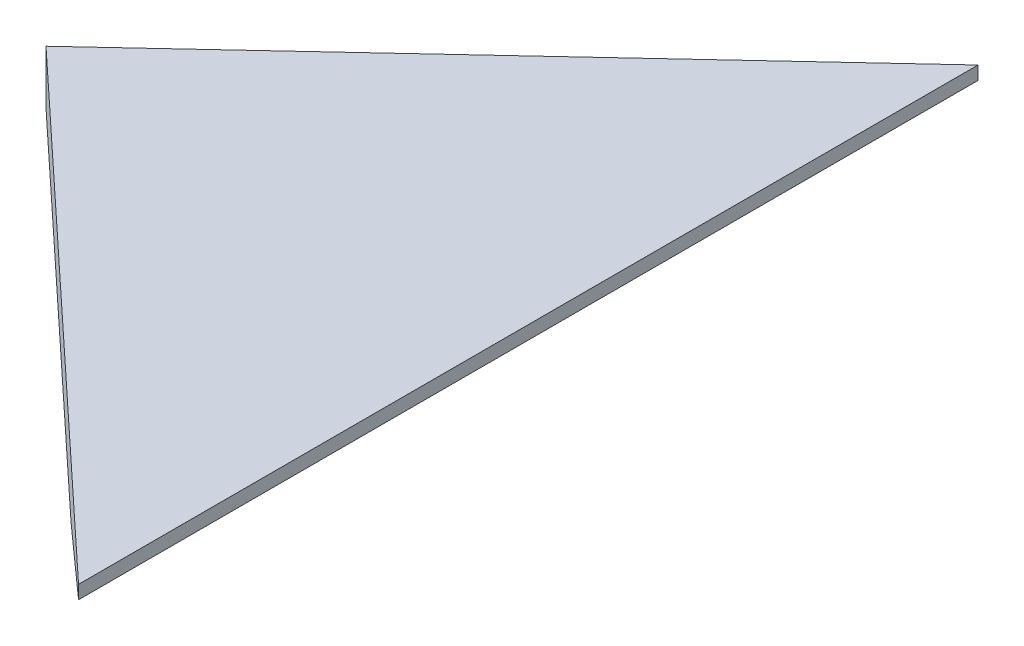
ISO-10303-21;
HEADER;
FILE_DESCRIPTION(('STEP AP214'),'2;1');
FILE_NAME('part.step','',(''),(''),'','','');
FILE_SCHEMA(('AUTOMOTIVE_DESIGN { 1 0 10303 214 1 1 1 1 }'));
ENDSEC;
DATA;
#1=APPLICATION_CONTEXT('core data for automotive mechanical design processes');
#2=APPLICATION_PROTOCOL_DEFINITION('international standard','automotive_design',2000,#1);
#3=PRODUCT_CONTEXT('',#1,'mechanical');
#4=PRODUCT('Part','Part','',(#3));
#5=PRODUCT_RELATED_PRODUCT_CATEGORY('part','',(#4));
#6=PRODUCT_DEFINITION_FORMATION('','',#4);
#7=PRODUCT_DEFINITION_CONTEXT('part definition',#1,'design');
#8=PRODUCT_DEFINITION('design','',#6,#7);
#9=PRODUCT_DEFINITION_SHAPE('','',#8);
#10=(LENGTH_UNIT() NAMED_UNIT(*) SI_UNIT(.MILLI.,.METRE.));
#11=(NAMED_UNIT(*) PLANE_ANGLE_UNIT() SI_UNIT($,.RADIAN.));
#12=(NAMED_UNIT(*) SI_UNIT($,.STERADIAN.) SOLID_ANGLE_UNIT());
#13=UNCERTAINTY_MEASURE_WITH_UNIT(LENGTH_MEASURE(1.E-05),#10,'distance_accuracy_value','');
#14=(GEOMETRIC_REPRESENTATION_CONTEXT(3) GLOBAL_UNCERTAINTY_ASSIGNED_CONTEXT((#13)) GLOBAL_UNIT_ASSIGNED_CONTEXT((#10,
#11,#12)) REPRESENTATION_CONTEXT('',''));
#15=CARTESIAN_POINT('',(0.,0.,0.));
#16=DIRECTION('',(0.,0.,1.));
#17=DIRECTION('',(1.,0.,0.));
#18=AXIS2_PLACEMENT_3D('',#15,#16,#17);
#19=CARTESIAN_POINT('',(88.1302775796943,0.,152.4));
#20=DIRECTION('',(0.,1.,0.));
#21=DIRECTION('',(0.,0.,1.));
#22=AXIS2_PLACEMENT_3D('',#19,#20,#21);
#23=PLANE('',#22);
#24=DIRECTION('',(0.731353701619172,0.,0.681998360062497));
#25=VECTOR('',#24,1.);
#26=CARTESIAN_POINT('',(0.,0.,0.));
#27=LINE('',#26,#25);
#28=CARTESIAN_POINT('',(0.,0.,0.));
#29=VERTEX_POINT('',#28);
#30=CARTESIAN_POINT('',(88.1302775796944,0.,82.1828133885644));
#31=VERTEX_POINT('',#30);
#32=EDGE_CURVE('E88',#29,#31,#27,.T.);
#33=ORIENTED_EDGE('',*,*,#32,.F.);
#34=DIRECTION('',(-0.731353701619172,0.,0.681998360062497));
#35=VECTOR('',#34,1.);
#36=CARTESIAN_POINT('',(155.264337474048,0.,-144.786337033718));
#37=LINE('',#36,#35);
#38=CARTESIAN_POINT('',(88.1302775796941,0.,-82.1828133885642));
#39=VERTEX_POINT('',#38);
#40=EDGE_CURVE('E77',#39,#29,#37,.T.);
#41=ORIENTED_EDGE('',*,*,#40,.F.);
#42=DIRECTION('',(0.,0.,-1.));
#43=VECTOR('',#42,1.);
#44=CARTESIAN_POINT('',(88.1302775796943,0.,152.4));
#45=LINE('',#44,#43);
#46=EDGE_CURVE('E12',#31,#39,#45,.T.);
#47=ORIENTED_EDGE('',*,*,#46,.F.);
#48=EDGE_LOOP('',(#33,#41,#47));
#49=FACE_BOUND('',#48,.T.);
#50=ADVANCED_FACE('F33',(#49),#23,.F.);
#51=CARTESIAN_POINT('',(114.3,9.52499999999999,152.4));
#52=DIRECTION('',(-0.342020143325663,0.93969262078591,0.));
#53=DIRECTION('',(-0.93969262078591,-0.342020143325663,0.));
#54=AXIS2_PLACEMENT_3D('',#51,#52,#53);
#55=PLANE('',#54);
#56=ORIENTED_EDGE('',*,*,#46,.T.);
#57=DIRECTION('',(0.706743128667203,0.257233462107026,-0.659048629506295));
#58=VECTOR('',#57,1.);
#59=CARTESIAN_POINT('',(-6.33022545002,-34.3808114166278,5.90303073079618));
#60=LINE('',#59,#58);
#61=CARTESIAN_POINT('',(114.3,9.52499999999999,-106.586474345534));
#62=VERTEX_POINT('',#61);
#63=EDGE_CURVE('E98',#39,#62,#60,.T.);
#64=ORIENTED_EDGE('',*,*,#63,.T.);
#65=DIRECTION('',(0.,0.,-1.));
#66=VECTOR('',#65,1.);
#67=CARTESIAN_POINT('',(114.3,9.52499999999999,152.4));
#68=LINE('',#67,#66);
#69=CARTESIAN_POINT('',(114.3,9.52499999999999,106.586474345534));
#70=VERTEX_POINT('',#69);
#71=EDGE_CURVE('E40',#70,#62,#68,.T.);
#72=ORIENTED_EDGE('',*,*,#71,.F.);
#73=DIRECTION('',(-0.706743128667203,-0.257233462107026,-0.659048629506295));
#74=VECTOR('',#73,1.);
#75=CARTESIAN_POINT('',(135.638936492047,17.2917377140017,126.485354546501));
#76=LINE('',#75,#74);
#77=EDGE_CURVE('E94',#70,#31,#76,.T.);
#78=ORIENTED_EDGE('',*,*,#77,.T.);
#79=EDGE_LOOP('',(#56,#64,#72,#78));
#80=FACE_BOUND('',#79,.T.);
#81=ADVANCED_FACE('F105',(#80),#55,.F.);
#82=CARTESIAN_POINT('',(114.3,12.7,152.4));
#83=DIRECTION('',(-1.,0.,0.));
#84=DIRECTION('',(0.,0.,1.));
#85=AXIS2_PLACEMENT_3D('',#82,#83,#84);
#86=PLANE('',#85);
#87=ORIENTED_EDGE('',*,*,#71,.T.);
#88=DIRECTION('',(0.,1.,0.));
#89=VECTOR('',#88,1.);
#90=CARTESIAN_POINT('',(114.3,12.7,-106.586474345534));
#91=LINE('',#90,#89);
#92=CARTESIAN_POINT('',(114.3,12.7,-106.586474345534));
#93=VERTEX_POINT('',#92);
#94=EDGE_CURVE('E55',#62,#93,#91,.T.);
#95=ORIENTED_EDGE('',*,*,#94,.T.);
#96=DIRECTION('',(0.,0.,-1.));
#97=VECTOR('',#96,1.);
#98=CARTESIAN_POINT('',(114.3,12.7,152.4));
#99=LINE('',#98,#97);
#100=CARTESIAN_POINT('',(114.3,12.7,106.586474345534));
#101=VERTEX_POINT('',#100);
#102=EDGE_CURVE('E87',#101,#93,#99,.T.);
#103=ORIENTED_EDGE('',*,*,#102,.F.);
#104=DIRECTION('',(0.,-1.,0.));
#105=VECTOR('',#104,1.);
#106=CARTESIAN_POINT('',(114.3,12.7,106.586474345534));
#107=LINE('',#106,#105);
#108=EDGE_CURVE('E47',#101,#70,#107,.T.);
#109=ORIENTED_EDGE('',*,*,#108,.T.);
#110=EDGE_LOOP('',(#87,#95,#103,#109));
#111=FACE_BOUND('',#110,.T.);
#112=ADVANCED_FACE('F103',(#111),#86,.F.);
#113=CARTESIAN_POINT('',(0.,12.7,152.4));
#114=DIRECTION('',(0.,-1.,0.));
#115=DIRECTION('',(1.,0.,0.));
#116=AXIS2_PLACEMENT_3D('',#113,#114,#115);
#117=PLANE('',#116);
#118=ORIENTED_EDGE('',*,*,#102,.T.);
#119=DIRECTION('',(-0.731353701619172,0.,0.681998360062497));
#120=VECTOR('',#119,1.);
#121=CARTESIAN_POINT('',(155.264337474048,12.7,-144.786337033718));
#122=LINE('',#121,#120);
#123=CARTESIAN_POINT('',(0.,12.7,0.));
#124=VERTEX_POINT('',#123);
#125=EDGE_CURVE('E75',#93,#124,#122,.T.);
#126=ORIENTED_EDGE('',*,*,#125,.T.);
#127=DIRECTION('',(0.731353701619172,0.,0.681998360062497));
#128=VECTOR('',#127,1.);
#129=CARTESIAN_POINT('',(0.,12.7,0.));
#130=LINE('',#129,#128);
#131=EDGE_CURVE('E79',#124,#101,#130,.T.);
#132=ORIENTED_EDGE('',*,*,#131,.T.);
#133=EDGE_LOOP('',(#118,#126,#132));
#134=FACE_BOUND('',#133,.T.);
#135=ADVANCED_FACE('F86',(#134),#117,.F.);
#136=CARTESIAN_POINT('',(155.264337474048,12.7,-144.786337033718));
#137=DIRECTION('',(0.681998360062497,0.,0.731353701619172));
#138=DIRECTION('',(0.731353701619172,0.,-0.681998360062497));
#139=AXIS2_PLACEMENT_3D('',#136,#137,#138);
#140=PLANE('',#139);
#141=ORIENTED_EDGE('',*,*,#40,.T.);
#142=DIRECTION('',(0.,-1.,0.));
#143=VECTOR('',#142,1.);
#144=CARTESIAN_POINT('',(0.,12.7,0.));
#145=LINE('',#144,#143);
#146=EDGE_CURVE('E72',#124,#29,#145,.T.);
#147=ORIENTED_EDGE('',*,*,#146,.F.);
#148=ORIENTED_EDGE('',*,*,#125,.F.);
#149=ORIENTED_EDGE('',*,*,#94,.F.);
#150=ORIENTED_EDGE('',*,*,#63,.F.);
#151=EDGE_LOOP('',(#141,#147,#148,#149,#150));
#152=FACE_BOUND('',#151,.T.);
#153=ADVANCED_FACE('F73',(#152),#140,.F.);
#154=CARTESIAN_POINT('',(0.,12.7,0.));
#155=DIRECTION('',(0.681998360062497,0.,-0.731353701619172));
#156=DIRECTION('',(-0.731353701619172,0.,-0.681998360062497));
#157=AXIS2_PLACEMENT_3D('',#154,#155,#156);
#158=PLANE('',#157);
#159=ORIENTED_EDGE('',*,*,#108,.F.);
#160=ORIENTED_EDGE('',*,*,#131,.F.);
#161=ORIENTED_EDGE('',*,*,#146,.T.);
#162=ORIENTED_EDGE('',*,*,#32,.T.);
#163=ORIENTED_EDGE('',*,*,#77,.F.);
#164=EDGE_LOOP('',(#159,#160,#161,#162,#163));
#165=FACE_BOUND('',#164,.T.);
#166=ADVANCED_FACE('F81',(#165),#158,.F.);
#167=CLOSED_SHELL('',(#50,#81,#112,#135,#153,#166));
#168=MANIFOLD_SOLID_BREP('B2',#167);
#169=ADVANCED_BREP_SHAPE_REPRESENTATION('',(#18,#168),#14);
#170=SHAPE_DEFINITION_REPRESENTATION(#9,#169);
ENDSEC;
END-ISO-10303-21;
